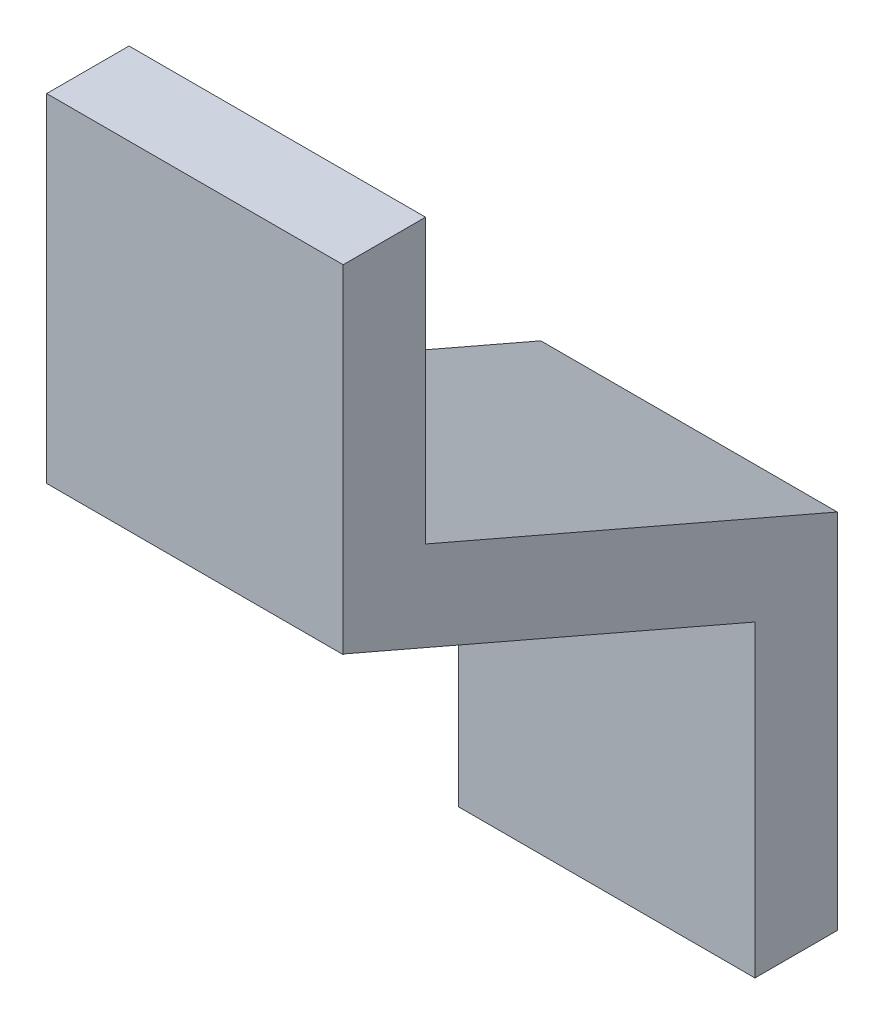
ISO-10303-21;
HEADER;
FILE_DESCRIPTION(('STEP AP214'),'2;1');
FILE_NAME('part.step','',(''),(''),'','','');
FILE_SCHEMA(('AUTOMOTIVE_DESIGN { 1 0 10303 214 1 1 1 1 }'));
ENDSEC;
DATA;
#1=APPLICATION_CONTEXT('core data for automotive mechanical design processes');
#2=APPLICATION_PROTOCOL_DEFINITION('international standard','automotive_design',2000,#1);
#3=PRODUCT_CONTEXT('',#1,'mechanical');
#4=PRODUCT('Part','Part','',(#3));
#5=PRODUCT_RELATED_PRODUCT_CATEGORY('part','',(#4));
#6=PRODUCT_DEFINITION_FORMATION('','',#4);
#7=PRODUCT_DEFINITION_CONTEXT('part definition',#1,'design');
#8=PRODUCT_DEFINITION('design','',#6,#7);
#9=PRODUCT_DEFINITION_SHAPE('','',#8);
#10=(LENGTH_UNIT() NAMED_UNIT(*) SI_UNIT(.MILLI.,.METRE.));
#11=(NAMED_UNIT(*) PLANE_ANGLE_UNIT() SI_UNIT($,.RADIAN.));
#12=(NAMED_UNIT(*) SI_UNIT($,.STERADIAN.) SOLID_ANGLE_UNIT());
#13=UNCERTAINTY_MEASURE_WITH_UNIT(LENGTH_MEASURE(1.E-05),#10,'distance_accuracy_value','');
#14=(GEOMETRIC_REPRESENTATION_CONTEXT(3) GLOBAL_UNCERTAINTY_ASSIGNED_CONTEXT((#13)) GLOBAL_UNIT_ASSIGNED_CONTEXT((#10,
#11,#12)) REPRESENTATION_CONTEXT('',''));
#15=CARTESIAN_POINT('',(0.,0.,0.));
#16=DIRECTION('',(0.,0.,1.));
#17=DIRECTION('',(1.,0.,0.));
#18=AXIS2_PLACEMENT_3D('',#15,#16,#17);
#19=CARTESIAN_POINT('',(1.82,0.999999996424,0.5));
#20=DIRECTION('',(0.,1.,0.));
#21=DIRECTION('',(0.,0.,1.));
#22=AXIS2_PLACEMENT_3D('',#19,#20,#21);
#23=PLANE('',#22);
#24=DIRECTION('',(1.,0.,0.));
#25=VECTOR('',#24,1.);
#26=CARTESIAN_POINT('',(1.82,0.999999996424,0.5));
#27=LINE('',#26,#25);
#28=CARTESIAN_POINT('',(2.180000014305,0.999999996424,0.5));
#29=VERTEX_POINT('',#28);
#30=CARTESIAN_POINT('',(1.82,0.999999996424,0.5));
#31=VERTEX_POINT('',#30);
#32=EDGE_CURVE('E140',#29,#31,#27,.F.);
#33=ORIENTED_EDGE('',*,*,#32,.T.);
#34=DIRECTION('',(0.,0.,-1.));
#35=VECTOR('',#34,1.);
#36=CARTESIAN_POINT('',(1.82,0.999999996424,0.));
#37=LINE('',#36,#35);
#38=CARTESIAN_POINT('',(1.82,0.999999996424,0.60000000149));
#39=VERTEX_POINT('',#38);
#40=EDGE_CURVE('E133',#31,#39,#37,.F.);
#41=ORIENTED_EDGE('',*,*,#40,.T.);
#42=DIRECTION('',(1.,0.,0.));
#43=VECTOR('',#42,1.);
#44=CARTESIAN_POINT('',(1.82,0.999999996424,0.60000000149));
#45=LINE('',#44,#43);
#46=CARTESIAN_POINT('',(2.180000014305,0.999999996424,0.60000000149));
#47=VERTEX_POINT('',#46);
#48=EDGE_CURVE('E129',#47,#39,#45,.F.);
#49=ORIENTED_EDGE('',*,*,#48,.F.);
#50=DIRECTION('',(0.,0.,-1.));
#51=VECTOR('',#50,1.);
#52=CARTESIAN_POINT('',(2.180000014305,0.999999996424,0.));
#53=LINE('',#52,#51);
#54=EDGE_CURVE('E106',#29,#47,#53,.F.);
#55=ORIENTED_EDGE('',*,*,#54,.F.);
#56=EDGE_LOOP('',(#33,#41,#49,#55));
#57=FACE_BOUND('',#56,.T.);
#58=ADVANCED_FACE('F17',(#57),#23,.T.);
#59=CARTESIAN_POINT('',(1.82,0.59,0.60000000149));
#60=DIRECTION('',(0.,0.,1.));
#61=DIRECTION('',(1.,0.,0.));
#62=AXIS2_PLACEMENT_3D('',#59,#60,#61);
#63=PLANE('',#62);
#64=DIRECTION('',(0.,1.,0.));
#65=VECTOR('',#64,1.);
#66=CARTESIAN_POINT('',(1.82,0.44,0.60000000149));
#67=LINE('',#66,#65);
#68=CARTESIAN_POINT('',(1.82,0.59,0.60000000149));
#69=VERTEX_POINT('',#68);
#70=EDGE_CURVE('E136',#39,#69,#67,.F.);
#71=ORIENTED_EDGE('',*,*,#70,.T.);
#72=DIRECTION('',(1.,0.,0.));
#73=VECTOR('',#72,1.);
#74=CARTESIAN_POINT('',(1.82,0.59,0.60000000149));
#75=LINE('',#74,#73);
#76=CARTESIAN_POINT('',(2.180000014305,0.59,0.60000000149));
#77=VERTEX_POINT('',#76);
#78=EDGE_CURVE('E92',#69,#77,#75,.T.);
#79=ORIENTED_EDGE('',*,*,#78,.T.);
#80=DIRECTION('',(0.,1.,0.));
#81=VECTOR('',#80,1.);
#82=CARTESIAN_POINT('',(2.180000014305,0.44,0.60000000149));
#83=LINE('',#82,#81);
#84=EDGE_CURVE('E73',#47,#77,#83,.F.);
#85=ORIENTED_EDGE('',*,*,#84,.F.);
#86=ORIENTED_EDGE('',*,*,#48,.T.);
#87=EDGE_LOOP('',(#71,#79,#85,#86));
#88=FACE_BOUND('',#87,.T.);
#89=ADVANCED_FACE('F285',(#88),#63,.T.);
#90=CARTESIAN_POINT('',(1.82,0.59,0.5));
#91=DIRECTION('',(0.,1.,0.));
#92=DIRECTION('',(0.,0.,1.));
#93=AXIS2_PLACEMENT_3D('',#90,#91,#92);
#94=PLANE('',#93);
#95=DIRECTION('',(1.,0.,0.));
#96=VECTOR('',#95,1.);
#97=CARTESIAN_POINT('',(1.82,0.590000000000416,0.59842599626982));
#98=LINE('',#97,#96);
#99=CARTESIAN_POINT('',(2.180000014305,0.590000000000104,0.598425996269911));
#100=VERTEX_POINT('',#99);
#101=CARTESIAN_POINT('',(1.82,0.590000000000104,0.59842599626991));
#102=VERTEX_POINT('',#101);
#103=EDGE_CURVE('E84',#100,#102,#98,.F.);
#104=ORIENTED_EDGE('',*,*,#103,.F.);
#105=DIRECTION('',(0.,0.,-1.));
#106=VECTOR('',#105,1.);
#107=CARTESIAN_POINT('',(2.180000014305,0.59,0.));
#108=LINE('',#107,#106);
#109=EDGE_CURVE('E20',#77,#100,#108,.T.);
#110=ORIENTED_EDGE('',*,*,#109,.F.);
#111=ORIENTED_EDGE('',*,*,#78,.F.);
#112=DIRECTION('',(0.,0.,1.));
#113=VECTOR('',#112,1.);
#114=CARTESIAN_POINT('',(1.82,0.59,0.5));
#115=LINE('',#114,#113);
#116=EDGE_CURVE('E87',#69,#102,#115,.F.);
#117=ORIENTED_EDGE('',*,*,#116,.T.);
#118=EDGE_LOOP('',(#104,#110,#111,#117));
#119=FACE_BOUND('',#118,.T.);
#120=ADVANCED_FACE('F85',(#119),#94,.F.);
#121=CARTESIAN_POINT('',(1.82,0.348224508223,0.03971472531736));
#122=DIRECTION('',(0.,-0.917754904098641,0.397147247255844));
#123=DIRECTION('',(0.,-0.397147247255844,-0.917754904098641));
#124=AXIS2_PLACEMENT_3D('',#121,#122,#123);
#125=PLANE('',#124);
#126=DIRECTION('',(0.,-0.397147247255413,-0.917754904098827));
#127=VECTOR('',#126,1.);
#128=CARTESIAN_POINT('',(2.180000014305,0.59,0.59842599627));
#129=LINE('',#128,#127);
#130=CARTESIAN_POINT('',(2.180000014305,0.37431222660502,0.10000000149));
#131=VERTEX_POINT('',#130);
#132=EDGE_CURVE('E80',#100,#131,#129,.T.);
#133=ORIENTED_EDGE('',*,*,#132,.F.);
#134=ORIENTED_EDGE('',*,*,#103,.T.);
#135=DIRECTION('',(0.,-0.397147247255413,-0.917754904098827));
#136=VECTOR('',#135,1.);
#137=CARTESIAN_POINT('',(1.82,0.59,0.59842599627));
#138=LINE('',#137,#136);
#139=CARTESIAN_POINT('',(1.82,0.374312226605,0.10000000149));
#140=VERTEX_POINT('',#139);
#141=EDGE_CURVE('E122',#102,#140,#138,.T.);
#142=ORIENTED_EDGE('',*,*,#141,.T.);
#143=DIRECTION('',(1.,0.,0.));
#144=VECTOR('',#143,1.);
#145=CARTESIAN_POINT('',(1.82,0.374312226605,0.10000000149));
#146=LINE('',#145,#144);
#147=EDGE_CURVE('E91',#131,#140,#146,.F.);
#148=ORIENTED_EDGE('',*,*,#147,.F.);
#149=EDGE_LOOP('',(#133,#134,#142,#148));
#150=FACE_BOUND('',#149,.T.);
#151=ADVANCED_FACE('F94',(#150),#125,.T.);
#152=CARTESIAN_POINT('',(1.82,0.,0.10000000149));
#153=DIRECTION('',(0.,0.,1.));
#154=DIRECTION('',(1.,0.,0.));
#155=AXIS2_PLACEMENT_3D('',#152,#153,#154);
#156=PLANE('',#155);
#157=ORIENTED_EDGE('',*,*,#147,.T.);
#158=DIRECTION('',(0.,1.,0.));
#159=VECTOR('',#158,1.);
#160=CARTESIAN_POINT('',(1.82,0.44,0.10000000149));
#161=LINE('',#160,#159);
#162=CARTESIAN_POINT('',(1.82,0.,0.10000000149));
#163=VERTEX_POINT('',#162);
#164=EDGE_CURVE('E118',#140,#163,#161,.F.);
#165=ORIENTED_EDGE('',*,*,#164,.T.);
#166=DIRECTION('',(1.,0.,0.));
#167=VECTOR('',#166,1.);
#168=CARTESIAN_POINT('',(1.82,0.,0.10000000149));
#169=LINE('',#168,#167);
#170=CARTESIAN_POINT('',(2.180000014305,0.,0.10000000149));
#171=VERTEX_POINT('',#170);
#172=EDGE_CURVE('E115',#163,#171,#169,.T.);
#173=ORIENTED_EDGE('',*,*,#172,.T.);
#174=DIRECTION('',(0.,1.,0.));
#175=VECTOR('',#174,1.);
#176=CARTESIAN_POINT('',(2.180000014305,0.44,0.10000000149));
#177=LINE('',#176,#175);
#178=EDGE_CURVE('E96',#131,#171,#177,.F.);
#179=ORIENTED_EDGE('',*,*,#178,.F.);
#180=EDGE_LOOP('',(#157,#165,#173,#179));
#181=FACE_BOUND('',#180,.T.);
#182=ADVANCED_FACE('F202',(#181),#156,.T.);
#183=CARTESIAN_POINT('',(1.82,0.,0.));
#184=DIRECTION('',(0.,1.,0.));
#185=DIRECTION('',(0.,0.,1.));
#186=AXIS2_PLACEMENT_3D('',#183,#184,#185);
#187=PLANE('',#186);
#188=DIRECTION('',(0.,0.,-1.));
#189=VECTOR('',#188,1.);
#190=CARTESIAN_POINT('',(1.82,0.,0.));
#191=LINE('',#190,#189);
#192=CARTESIAN_POINT('',(1.82,0.,0.));
#193=VERTEX_POINT('',#192);
#194=EDGE_CURVE('E121',#163,#193,#191,.T.);
#195=ORIENTED_EDGE('',*,*,#194,.T.);
#196=DIRECTION('',(1.,0.,0.));
#197=VECTOR('',#196,1.);
#198=CARTESIAN_POINT('',(1.82,0.,0.));
#199=LINE('',#198,#197);
#200=CARTESIAN_POINT('',(2.180000014305,0.,0.));
#201=VERTEX_POINT('',#200);
#202=EDGE_CURVE('E112',#193,#201,#199,.T.);
#203=ORIENTED_EDGE('',*,*,#202,.T.);
#204=DIRECTION('',(0.,0.,-1.));
#205=VECTOR('',#204,1.);
#206=CARTESIAN_POINT('',(2.180000014305,0.,0.));
#207=LINE('',#206,#205);
#208=EDGE_CURVE('E98',#171,#201,#207,.T.);
#209=ORIENTED_EDGE('',*,*,#208,.F.);
#210=ORIENTED_EDGE('',*,*,#172,.F.);
#211=EDGE_LOOP('',(#195,#203,#209,#210));
#212=FACE_BOUND('',#211,.T.);
#213=ADVANCED_FACE('F206',(#212),#187,.F.);
#214=CARTESIAN_POINT('',(1.82,0.,0.));
#215=DIRECTION('',(0.,0.,1.));
#216=DIRECTION('',(1.,0.,0.));
#217=AXIS2_PLACEMENT_3D('',#214,#215,#216);
#218=PLANE('',#217);
#219=ORIENTED_EDGE('',*,*,#202,.F.);
#220=DIRECTION('',(0.,1.,0.));
#221=VECTOR('',#220,1.);
#222=CARTESIAN_POINT('',(1.82,0.44,0.));
#223=LINE('',#222,#221);
#224=CARTESIAN_POINT('',(1.82,0.439999998997445,-1.94673175919965E-10));
#225=VERTEX_POINT('',#224);
#226=EDGE_CURVE('E178',#193,#225,#223,.T.);
#227=ORIENTED_EDGE('',*,*,#226,.T.);
#228=DIRECTION('',(1.,0.,0.));
#229=VECTOR('',#228,1.);
#230=CARTESIAN_POINT('',(1.82,0.43999999966303,-7.78692710220355E-10));
#231=LINE('',#230,#229);
#232=CARTESIAN_POINT('',(2.180000014305,0.439999998997445,-1.94673175919965E-10));
#233=VERTEX_POINT('',#232);
#234=EDGE_CURVE('E163',#225,#233,#231,.T.);
#235=ORIENTED_EDGE('',*,*,#234,.T.);
#236=DIRECTION('',(0.,1.,0.));
#237=VECTOR('',#236,1.);
#238=CARTESIAN_POINT('',(2.180000014305,0.44,0.));
#239=LINE('',#238,#237);
#240=EDGE_CURVE('E109',#201,#233,#239,.T.);
#241=ORIENTED_EDGE('',*,*,#240,.F.);
#242=EDGE_LOOP('',(#219,#227,#235,#241));
#243=FACE_BOUND('',#242,.T.);
#244=ADVANCED_FACE('F186',(#243),#218,.F.);
#245=CARTESIAN_POINT('',(2.180000014305,0.44,0.));
#246=DIRECTION('',(1.,0.,0.));
#247=DIRECTION('',(0.,0.,-1.));
#248=AXIS2_PLACEMENT_3D('',#245,#246,#247);
#249=PLANE('',#248);
#250=ORIENTED_EDGE('',*,*,#178,.T.);
#251=ORIENTED_EDGE('',*,*,#208,.T.);
#252=ORIENTED_EDGE('',*,*,#240,.T.);
#253=DIRECTION('',(0.,-0.397147247255844,-0.917754904098641));
#254=VECTOR('',#253,1.);
#255=CARTESIAN_POINT('',(2.180000014305,0.44,0.));
#256=LINE('',#255,#254);
#257=CARTESIAN_POINT('',(2.180000014305,0.656368904967003,0.499999999999999));
#258=VERTEX_POINT('',#257);
#259=EDGE_CURVE('E151',#233,#258,#256,.F.);
#260=ORIENTED_EDGE('',*,*,#259,.T.);
#261=DIRECTION('',(0.,1.,0.));
#262=VECTOR('',#261,1.);
#263=CARTESIAN_POINT('',(2.180000014305,0.59,0.5));
#264=LINE('',#263,#262);
#265=EDGE_CURVE('E144',#258,#29,#264,.T.);
#266=ORIENTED_EDGE('',*,*,#265,.T.);
#267=ORIENTED_EDGE('',*,*,#54,.T.);
#268=ORIENTED_EDGE('',*,*,#84,.T.);
#269=ORIENTED_EDGE('',*,*,#109,.T.);
#270=ORIENTED_EDGE('',*,*,#132,.T.);
#271=EDGE_LOOP('',(#250,#251,#252,#260,#266,#267,#268,#269,#270));
#272=FACE_BOUND('',#271,.T.);
#273=ADVANCED_FACE('F78',(#272),#249,.T.);
#274=CARTESIAN_POINT('',(1.82,0.59,0.5));
#275=DIRECTION('',(0.,0.,1.));
#276=DIRECTION('',(1.,0.,0.));
#277=AXIS2_PLACEMENT_3D('',#274,#275,#276);
#278=PLANE('',#277);
#279=ORIENTED_EDGE('',*,*,#265,.F.);
#280=DIRECTION('',(1.,0.,0.));
#281=VECTOR('',#280,1.);
#282=CARTESIAN_POINT('',(1.82,0.656368904967005,0.499999999999998));
#283=LINE('',#282,#281);
#284=CARTESIAN_POINT('',(1.82,0.656368904967001,0.5));
#285=VERTEX_POINT('',#284);
#286=EDGE_CURVE('E26',#258,#285,#283,.F.);
#287=ORIENTED_EDGE('',*,*,#286,.T.);
#288=DIRECTION('',(0.,1.,0.));
#289=VECTOR('',#288,1.);
#290=CARTESIAN_POINT('',(1.82,0.44,0.5));
#291=LINE('',#290,#289);
#292=EDGE_CURVE('E34',#285,#31,#291,.T.);
#293=ORIENTED_EDGE('',*,*,#292,.T.);
#294=ORIENTED_EDGE('',*,*,#32,.F.);
#295=EDGE_LOOP('',(#279,#287,#293,#294));
#296=FACE_BOUND('',#295,.T.);
#297=ADVANCED_FACE('F212',(#296),#278,.F.);
#298=CARTESIAN_POINT('',(1.82,0.44,0.));
#299=DIRECTION('',(1.,0.,0.));
#300=DIRECTION('',(0.,0.,-1.));
#301=AXIS2_PLACEMENT_3D('',#298,#299,#300);
#302=PLANE('',#301);
#303=ORIENTED_EDGE('',*,*,#226,.F.);
#304=ORIENTED_EDGE('',*,*,#194,.F.);
#305=ORIENTED_EDGE('',*,*,#164,.F.);
#306=ORIENTED_EDGE('',*,*,#141,.F.);
#307=ORIENTED_EDGE('',*,*,#116,.F.);
#308=ORIENTED_EDGE('',*,*,#70,.F.);
#309=ORIENTED_EDGE('',*,*,#40,.F.);
#310=ORIENTED_EDGE('',*,*,#292,.F.);
#311=DIRECTION('',(0.,-0.397147247255844,-0.917754904098641));
#312=VECTOR('',#311,1.);
#313=CARTESIAN_POINT('',(1.82,0.44,0.));
#314=LINE('',#313,#312);
#315=EDGE_CURVE('E11',#285,#225,#314,.T.);
#316=ORIENTED_EDGE('',*,*,#315,.T.);
#317=EDGE_LOOP('',(#303,#304,#305,#306,#307,#308,#309,#310,#316));
#318=FACE_BOUND('',#317,.T.);
#319=ADVANCED_FACE('F207',(#318),#302,.F.);
#320=CARTESIAN_POINT('',(1.82,0.44,0.));
#321=DIRECTION('',(0.,-0.917754904098641,0.397147247255844));
#322=DIRECTION('',(0.,-0.397147247255844,-0.917754904098641));
#323=AXIS2_PLACEMENT_3D('',#320,#321,#322);
#324=PLANE('',#323);
#325=ORIENTED_EDGE('',*,*,#286,.F.);
#326=ORIENTED_EDGE('',*,*,#259,.F.);
#327=ORIENTED_EDGE('',*,*,#234,.F.);
#328=ORIENTED_EDGE('',*,*,#315,.F.);
#329=EDGE_LOOP('',(#325,#326,#327,#328));
#330=FACE_BOUND('',#329,.T.);
#331=ADVANCED_FACE('F193',(#330),#324,.F.);
#332=CLOSED_SHELL('',(#58,#89,#120,#151,#182,#213,#244,#273,#297,#319,#331));
#333=MANIFOLD_SOLID_BREP('B1',#332);
#334=ADVANCED_BREP_SHAPE_REPRESENTATION('',(#18,#333),#14);
#335=SHAPE_DEFINITION_REPRESENTATION(#9,#334);
ENDSEC;
END-ISO-10303-21;
